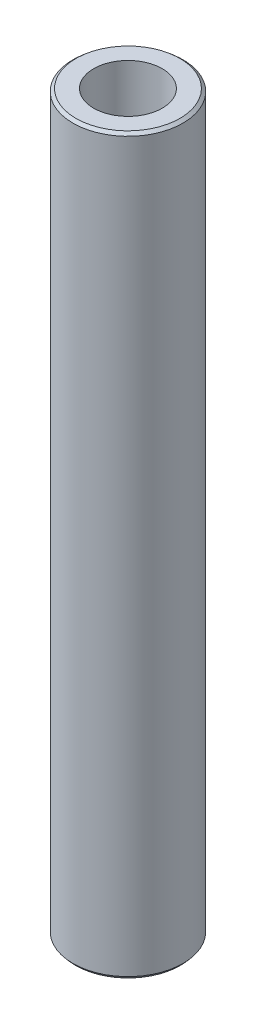
ISO-10303-21;
HEADER;
FILE_DESCRIPTION(('STEP AP214'),'2;1');
FILE_NAME('part.step','',(''),(''),'','','');
FILE_SCHEMA(('AUTOMOTIVE_DESIGN { 1 0 10303 214 1 1 1 1 }'));
ENDSEC;
DATA;
#1=APPLICATION_CONTEXT('core data for automotive mechanical design processes');
#2=APPLICATION_PROTOCOL_DEFINITION('international standard','automotive_design',2000,#1);
#3=PRODUCT_CONTEXT('',#1,'mechanical');
#4=PRODUCT('Part','Part','',(#3));
#5=PRODUCT_RELATED_PRODUCT_CATEGORY('part','',(#4));
#6=PRODUCT_DEFINITION_FORMATION('','',#4);
#7=PRODUCT_DEFINITION_CONTEXT('part definition',#1,'design');
#8=PRODUCT_DEFINITION('design','',#6,#7);
#9=PRODUCT_DEFINITION_SHAPE('','',#8);
#10=(LENGTH_UNIT() NAMED_UNIT(*) SI_UNIT(.MILLI.,.METRE.));
#11=(NAMED_UNIT(*) PLANE_ANGLE_UNIT() SI_UNIT($,.RADIAN.));
#12=(NAMED_UNIT(*) SI_UNIT($,.STERADIAN.) SOLID_ANGLE_UNIT());
#13=UNCERTAINTY_MEASURE_WITH_UNIT(LENGTH_MEASURE(1.E-05),#10,'distance_accuracy_value','');
#14=(GEOMETRIC_REPRESENTATION_CONTEXT(3) GLOBAL_UNCERTAINTY_ASSIGNED_CONTEXT((#13)) GLOBAL_UNIT_ASSIGNED_CONTEXT((#10,
#11,#12)) REPRESENTATION_CONTEXT('',''));
#15=CARTESIAN_POINT('',(0.,0.,0.));
#16=DIRECTION('',(0.,0.,1.));
#17=DIRECTION('',(1.,0.,0.));
#18=AXIS2_PLACEMENT_3D('',#15,#16,#17);
#19=CARTESIAN_POINT('',(0.,600.,0.));
#20=DIRECTION('',(0.,-1.,0.));
#21=DIRECTION('',(0.,0.,-1.));
#22=AXIS2_PLACEMENT_3D('',#19,#20,#21);
#23=CYLINDRICAL_SURFACE('',#22,45.);
#24=CARTESIAN_POINT('',(0.,597.885070898095,0.));
#25=DIRECTION('',(0.,1.,0.));
#26=DIRECTION('',(0.,0.,1.));
#27=AXIS2_PLACEMENT_3D('',#24,#25,#26);
#28=CIRCLE('',#27,45.);
#29=CARTESIAN_POINT('',(0.,597.885070898095,45.));
#30=VERTEX_POINT('',#29);
#31=EDGE_CURVE('E50',#30,#30,#28,.F.);
#32=ORIENTED_EDGE('',*,*,#31,.T.);
#33=EDGE_LOOP('',(#32));
#34=FACE_BOUND('',#33,.T.);
#35=CARTESIAN_POINT('',(0.,2.4857802400472,0.));
#36=DIRECTION('',(0.,1.,0.));
#37=DIRECTION('',(0.,0.,1.));
#38=AXIS2_PLACEMENT_3D('',#35,#36,#37);
#39=CIRCLE('',#38,45.);
#40=CARTESIAN_POINT('',(0.,2.4857802400472,45.));
#41=VERTEX_POINT('',#40);
#42=EDGE_CURVE('E51',#41,#41,#39,.T.);
#43=ORIENTED_EDGE('',*,*,#42,.T.);
#44=EDGE_LOOP('',(#43));
#45=FACE_BOUND('',#44,.T.);
#46=ADVANCED_FACE('F39',(#34,#45),#23,.T.);
#47=CARTESIAN_POINT('',(0.,600.,0.));
#48=DIRECTION('',(0.,1.,0.));
#49=DIRECTION('',(0.,0.,1.));
#50=AXIS2_PLACEMENT_3D('',#47,#48,#49);
#51=PLANE('',#50);
#52=CARTESIAN_POINT('',(0.,600.,0.));
#53=DIRECTION('',(0.,1.,0.));
#54=DIRECTION('',(0.,0.,1.));
#55=AXIS2_PLACEMENT_3D('',#52,#53,#54);
#56=CIRCLE('',#55,42.5142197599528);
#57=CARTESIAN_POINT('',(0.,600.,42.5142197599528));
#58=VERTEX_POINT('',#57);
#59=EDGE_CURVE('E54',#58,#58,#56,.T.);
#60=ORIENTED_EDGE('',*,*,#59,.T.);
#61=EDGE_LOOP('',(#60));
#62=FACE_BOUND('',#61,.T.);
#63=CARTESIAN_POINT('',(0.,600.,0.));
#64=DIRECTION('',(0.,1.,0.));
#65=DIRECTION('',(0.,0.,1.));
#66=AXIS2_PLACEMENT_3D('',#63,#64,#65);
#67=CIRCLE('',#66,28.0527801933633);
#68=CARTESIAN_POINT('',(0.,600.,28.0527801933633));
#69=VERTEX_POINT('',#68);
#70=EDGE_CURVE('E58',#69,#69,#67,.T.);
#71=ORIENTED_EDGE('',*,*,#70,.F.);
#72=EDGE_LOOP('',(#71));
#73=FACE_BOUND('',#72,.T.);
#74=ADVANCED_FACE('F69',(#62,#73),#51,.T.);
#75=CARTESIAN_POINT('',(0.,0.,0.));
#76=DIRECTION('',(0.,1.,0.));
#77=DIRECTION('',(0.,0.,1.));
#78=AXIS2_PLACEMENT_3D('',#75,#76,#77);
#79=PLANE('',#78);
#80=CARTESIAN_POINT('',(0.,0.,0.));
#81=DIRECTION('',(0.,1.,0.));
#82=DIRECTION('',(0.,0.,1.));
#83=AXIS2_PLACEMENT_3D('',#80,#81,#82);
#84=CIRCLE('',#83,42.8850708980946);
#85=CARTESIAN_POINT('',(0.,0.,42.8850708980946));
#86=VERTEX_POINT('',#85);
#87=EDGE_CURVE('E10',#86,#86,#84,.F.);
#88=ORIENTED_EDGE('',*,*,#87,.T.);
#89=EDGE_LOOP('',(#88));
#90=FACE_BOUND('',#89,.T.);
#91=CARTESIAN_POINT('',(0.,0.,0.));
#92=DIRECTION('',(0.,1.,0.));
#93=DIRECTION('',(0.,0.,1.));
#94=AXIS2_PLACEMENT_3D('',#91,#92,#93);
#95=CIRCLE('',#94,28.0527801933633);
#96=CARTESIAN_POINT('',(0.,0.,28.0527801933633));
#97=VERTEX_POINT('',#96);
#98=EDGE_CURVE('E63',#97,#97,#95,.T.);
#99=ORIENTED_EDGE('',*,*,#98,.T.);
#100=EDGE_LOOP('',(#99));
#101=FACE_BOUND('',#100,.T.);
#102=ADVANCED_FACE('F75',(#90,#101),#79,.F.);
#103=CARTESIAN_POINT('',(0.,600.,0.));
#104=DIRECTION('',(0.,-1.,0.));
#105=DIRECTION('',(0.,0.,-1.));
#106=AXIS2_PLACEMENT_3D('',#103,#104,#105);
#107=CYLINDRICAL_SURFACE('',#106,28.0527801933633);
#108=ORIENTED_EDGE('',*,*,#70,.T.);
#109=EDGE_LOOP('',(#108));
#110=FACE_BOUND('',#109,.T.);
#111=ORIENTED_EDGE('',*,*,#98,.F.);
#112=EDGE_LOOP('',(#111));
#113=FACE_BOUND('',#112,.T.);
#114=ADVANCED_FACE('F70',(#110,#113),#107,.F.);
#115=CARTESIAN_POINT('',(0.,600.,0.));
#116=DIRECTION('',(0.,-1.,0.));
#117=DIRECTION('',(0.,0.,-1.));
#118=AXIS2_PLACEMENT_3D('',#115,#116,#117);
#119=CONICAL_SURFACE('',#118,42.5142197599528,0.865831639966919);
#120=ORIENTED_EDGE('',*,*,#31,.F.);
#121=EDGE_LOOP('',(#120));
#122=FACE_BOUND('',#121,.T.);
#123=ORIENTED_EDGE('',*,*,#59,.F.);
#124=EDGE_LOOP('',(#123));
#125=FACE_BOUND('',#124,.T.);
#126=ADVANCED_FACE('F81',(#122,#125),#119,.T.);
#127=CARTESIAN_POINT('',(0.,2.4857802400472,0.));
#128=DIRECTION('',(0.,1.,0.));
#129=DIRECTION('',(0.,0.,1.));
#130=AXIS2_PLACEMENT_3D('',#127,#128,#129);
#131=CONICAL_SURFACE('',#130,45.,0.704964686827975);
#132=ORIENTED_EDGE('',*,*,#87,.F.);
#133=EDGE_LOOP('',(#132));
#134=FACE_BOUND('',#133,.T.);
#135=ORIENTED_EDGE('',*,*,#42,.F.);
#136=EDGE_LOOP('',(#135));
#137=FACE_BOUND('',#136,.T.);
#138=ADVANCED_FACE('F45',(#134,#137),#131,.T.);
#139=CLOSED_SHELL('',(#46,#74,#102,#114,#126,#138));
#140=MANIFOLD_SOLID_BREP('B2',#139);
#141=ADVANCED_BREP_SHAPE_REPRESENTATION('',(#18,#140),#14);
#142=SHAPE_DEFINITION_REPRESENTATION(#9,#141);
ENDSEC;
END-ISO-10303-21;
